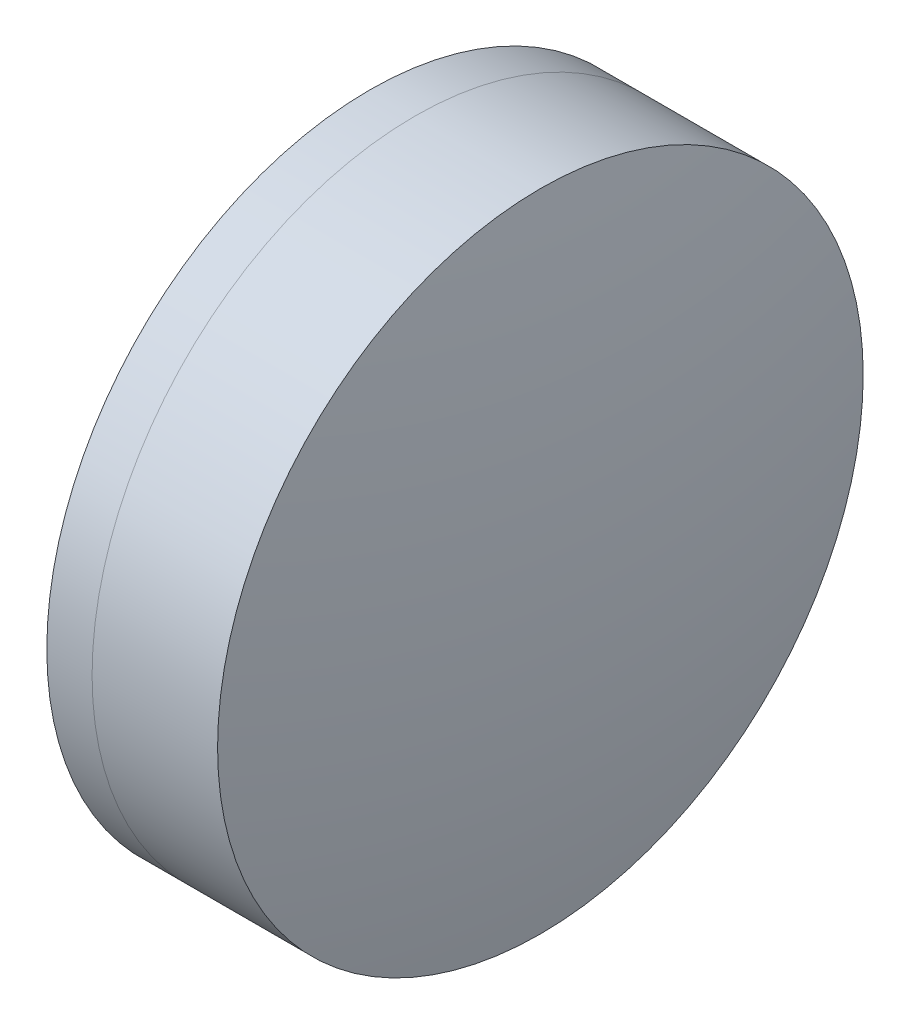
ISO-10303-21;
HEADER;
FILE_DESCRIPTION(('STEP AP214'),'2;1');
FILE_NAME('part.step','',(''),(''),'','','');
FILE_SCHEMA(('AUTOMOTIVE_DESIGN { 1 0 10303 214 1 1 1 1 }'));
ENDSEC;
DATA;
#1=APPLICATION_CONTEXT('core data for automotive mechanical design processes');
#2=APPLICATION_PROTOCOL_DEFINITION('international standard','automotive_design',2000,#1);
#3=PRODUCT_CONTEXT('',#1,'mechanical');
#4=PRODUCT('Part','Part','',(#3));
#5=PRODUCT_RELATED_PRODUCT_CATEGORY('part','',(#4));
#6=PRODUCT_DEFINITION_FORMATION('','',#4);
#7=PRODUCT_DEFINITION_CONTEXT('part definition',#1,'design');
#8=PRODUCT_DEFINITION('design','',#6,#7);
#9=PRODUCT_DEFINITION_SHAPE('','',#8);
#10=(LENGTH_UNIT() NAMED_UNIT(*) SI_UNIT(.MILLI.,.METRE.));
#11=(NAMED_UNIT(*) PLANE_ANGLE_UNIT() SI_UNIT($,.RADIAN.));
#12=(NAMED_UNIT(*) SI_UNIT($,.STERADIAN.) SOLID_ANGLE_UNIT());
#13=UNCERTAINTY_MEASURE_WITH_UNIT(LENGTH_MEASURE(1.E-05),#10,'distance_accuracy_value','');
#14=(GEOMETRIC_REPRESENTATION_CONTEXT(3) GLOBAL_UNCERTAINTY_ASSIGNED_CONTEXT((#13)) GLOBAL_UNIT_ASSIGNED_CONTEXT((#10,
#11,#12)) REPRESENTATION_CONTEXT('',''));
#15=CARTESIAN_POINT('',(0.,0.,0.));
#16=DIRECTION('',(0.,0.,1.));
#17=DIRECTION('',(1.,0.,0.));
#18=AXIS2_PLACEMENT_3D('',#15,#16,#17);
#19=CARTESIAN_POINT('',(14.8796689735747,0.,0.));
#20=DIRECTION('',(-1.,0.,0.));
#21=DIRECTION('',(0.,0.,1.));
#22=AXIS2_PLACEMENT_3D('',#19,#20,#21);
#23=SPHERICAL_SURFACE('',#22,23.6210000000001);
#24=CARTESIAN_POINT('',(34.9221648510847,0.,0.));
#25=DIRECTION('',(-1.,0.,0.));
#26=DIRECTION('',(0.,0.,1.));
#27=AXIS2_PLACEMENT_3D('',#24,#25,#26);
#28=CIRCLE('',#27,12.5);
#29=CARTESIAN_POINT('',(34.9221648510847,0.,12.5));
#30=VERTEX_POINT('',#29);
#31=EDGE_CURVE('E11',#30,#30,#28,.T.);
#32=ORIENTED_EDGE('',*,*,#31,.T.);
#33=EDGE_LOOP('',(#32));
#34=FACE_BOUND('',#33,.T.);
#35=ADVANCED_FACE('F45',(#34),#23,.F.);
#36=CARTESIAN_POINT('',(-0.551919992657797,0.,0.));
#37=DIRECTION('',(-1.,0.,0.));
#38=DIRECTION('',(0.,0.,1.));
#39=AXIS2_PLACEMENT_3D('',#36,#37,#38);
#40=CYLINDRICAL_SURFACE('',#39,12.5);
#41=CARTESIAN_POINT('',(39.7816705567506,0.,0.));
#42=DIRECTION('',(-1.,0.,0.));
#43=DIRECTION('',(0.,0.,1.));
#44=AXIS2_PLACEMENT_3D('',#41,#42,#43);
#45=CIRCLE('',#44,12.5);
#46=CARTESIAN_POINT('',(39.7816705567506,0.,12.5));
#47=VERTEX_POINT('',#46);
#48=EDGE_CURVE('E51',#47,#47,#45,.T.);
#49=ORIENTED_EDGE('',*,*,#48,.T.);
#50=EDGE_LOOP('',(#49));
#51=FACE_BOUND('',#50,.T.);
#52=ORIENTED_EDGE('',*,*,#31,.F.);
#53=EDGE_LOOP('',(#52));
#54=FACE_BOUND('',#53,.T.);
#55=ADVANCED_FACE('F57',(#51,#54),#40,.T.);
#56=CARTESIAN_POINT('',(-23.6983310264252,0.,0.));
#57=DIRECTION('',(-1.,0.,0.));
#58=DIRECTION('',(0.,0.,1.));
#59=AXIS2_PLACEMENT_3D('',#56,#57,#58);
#60=SPHERICAL_SURFACE('',#59,64.699);
#61=ORIENTED_EDGE('',*,*,#48,.F.);
#62=EDGE_LOOP('',(#61));
#63=FACE_BOUND('',#62,.T.);
#64=ADVANCED_FACE('F60',(#63),#60,.T.);
#65=CLOSED_SHELL('',(#35,#55,#64));
#66=MANIFOLD_SOLID_BREP('B2',#65);
#67=CARTESIAN_POINT('',(63.5846689735747,0.,0.));
#68=DIRECTION('',(-1.,0.,0.));
#69=DIRECTION('',(0.,0.,1.));
#70=AXIS2_PLACEMENT_3D('',#67,#68,#69);
#71=SPHERICAL_SURFACE('',#70,32.884);
#72=CARTESIAN_POINT('',(33.1690898076276,0.,0.));
#73=DIRECTION('',(-1.,0.,0.));
#74=DIRECTION('',(0.,0.,1.));
#75=AXIS2_PLACEMENT_3D('',#72,#73,#74);
#76=CIRCLE('',#75,12.5);
#77=CARTESIAN_POINT('',(33.1690898076276,0.,12.5));
#78=VERTEX_POINT('',#77);
#79=EDGE_CURVE('E44',#78,#78,#76,.T.);
#80=ORIENTED_EDGE('',*,*,#79,.T.);
#81=EDGE_LOOP('',(#80));
#82=FACE_BOUND('',#81,.T.);
#83=ADVANCED_FACE('F86',(#82),#71,.T.);
#84=CARTESIAN_POINT('',(-9.70261217833668,0.,0.));
#85=DIRECTION('',(-1.,0.,0.));
#86=DIRECTION('',(0.,0.,1.));
#87=AXIS2_PLACEMENT_3D('',#84,#85,#86);
#88=CYLINDRICAL_SURFACE('',#87,12.5);
#89=CARTESIAN_POINT('',(34.9221648510847,0.,0.));
#90=DIRECTION('',(-1.,0.,0.));
#91=DIRECTION('',(0.,0.,1.));
#92=AXIS2_PLACEMENT_3D('',#89,#90,#91);
#93=CIRCLE('',#92,12.5);
#94=CARTESIAN_POINT('',(34.9221648510847,0.,12.5));
#95=VERTEX_POINT('',#94);
#96=EDGE_CURVE('E92',#95,#95,#93,.T.);
#97=ORIENTED_EDGE('',*,*,#96,.T.);
#98=EDGE_LOOP('',(#97));
#99=FACE_BOUND('',#98,.T.);
#100=ORIENTED_EDGE('',*,*,#79,.F.);
#101=EDGE_LOOP('',(#100));
#102=FACE_BOUND('',#101,.T.);
#103=ADVANCED_FACE('F98',(#99,#102),#88,.T.);
#104=CARTESIAN_POINT('',(14.8796689735747,0.,0.));
#105=DIRECTION('',(-1.,0.,0.));
#106=DIRECTION('',(0.,0.,1.));
#107=AXIS2_PLACEMENT_3D('',#104,#105,#106);
#108=SPHERICAL_SURFACE('',#107,23.6210000000001);
#109=ORIENTED_EDGE('',*,*,#96,.F.);
#110=EDGE_LOOP('',(#109));
#111=FACE_BOUND('',#110,.T.);
#112=ADVANCED_FACE('F101',(#111),#108,.T.);
#113=CLOSED_SHELL('',(#83,#103,#112));
#114=MANIFOLD_SOLID_BREP('B6',#113);
#115=ADVANCED_BREP_SHAPE_REPRESENTATION('',(#18,#66,#114),#14);
#116=SHAPE_DEFINITION_REPRESENTATION(#9,#115);
ENDSEC;
END-ISO-10303-21;
